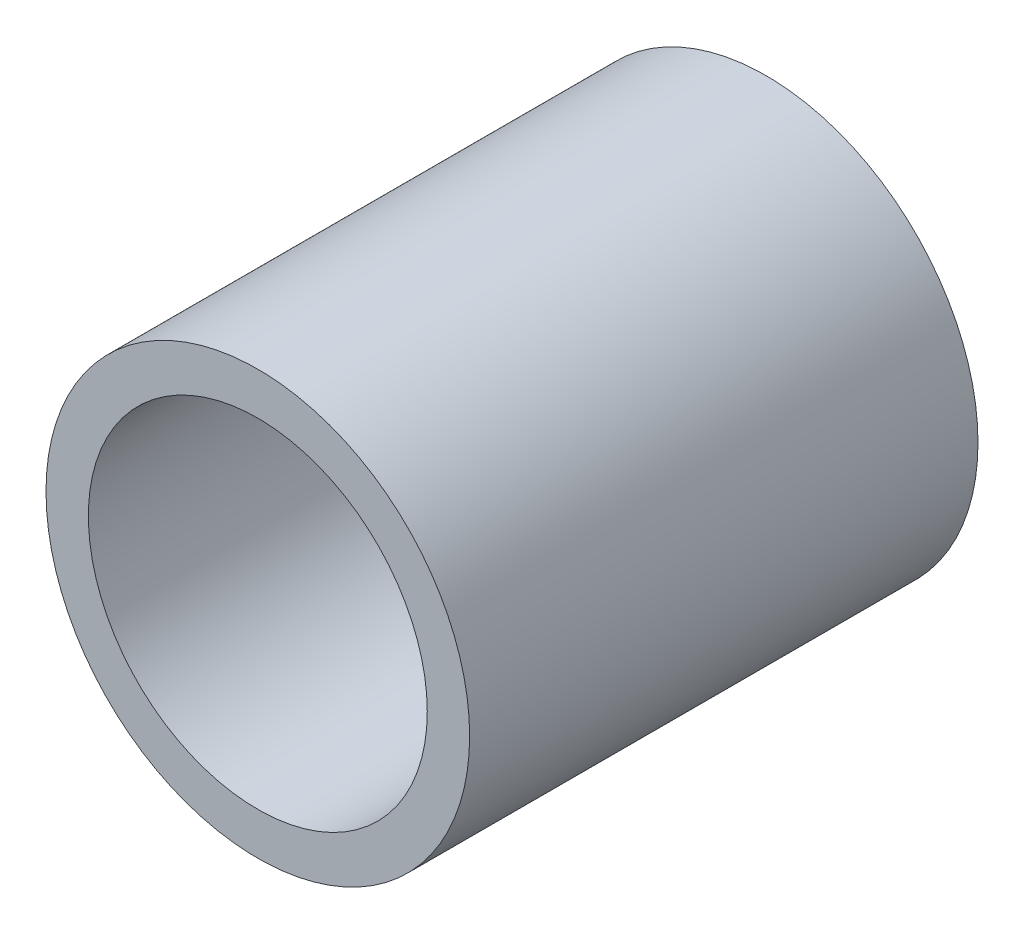
ISO-10303-21;
HEADER;
FILE_DESCRIPTION(('STEP AP214'),'2;1');
FILE_NAME('part.step','',(''),(''),'','','');
FILE_SCHEMA(('AUTOMOTIVE_DESIGN { 1 0 10303 214 1 1 1 1 }'));
ENDSEC;
DATA;
#1=APPLICATION_CONTEXT('core data for automotive mechanical design processes');
#2=APPLICATION_PROTOCOL_DEFINITION('international standard','automotive_design',2000,#1);
#3=PRODUCT_CONTEXT('',#1,'mechanical');
#4=PRODUCT('Part','Part','',(#3));
#5=PRODUCT_RELATED_PRODUCT_CATEGORY('part','',(#4));
#6=PRODUCT_DEFINITION_FORMATION('','',#4);
#7=PRODUCT_DEFINITION_CONTEXT('part definition',#1,'design');
#8=PRODUCT_DEFINITION('design','',#6,#7);
#9=PRODUCT_DEFINITION_SHAPE('','',#8);
#10=(LENGTH_UNIT() NAMED_UNIT(*) SI_UNIT(.MILLI.,.METRE.));
#11=(NAMED_UNIT(*) PLANE_ANGLE_UNIT() SI_UNIT($,.RADIAN.));
#12=(NAMED_UNIT(*) SI_UNIT($,.STERADIAN.) SOLID_ANGLE_UNIT());
#13=UNCERTAINTY_MEASURE_WITH_UNIT(LENGTH_MEASURE(1.E-05),#10,'distance_accuracy_value','');
#14=(GEOMETRIC_REPRESENTATION_CONTEXT(3) GLOBAL_UNCERTAINTY_ASSIGNED_CONTEXT((#13)) GLOBAL_UNIT_ASSIGNED_CONTEXT((#10,
#11,#12)) REPRESENTATION_CONTEXT('',''));
#15=CARTESIAN_POINT('',(0.,0.,0.));
#16=DIRECTION('',(0.,0.,1.));
#17=DIRECTION('',(1.,0.,0.));
#18=AXIS2_PLACEMENT_3D('',#15,#16,#17);
#19=CARTESIAN_POINT('',(0.,0.,0.3));
#20=DIRECTION('',(0.,0.,1.));
#21=DIRECTION('',(1.,0.,0.));
#22=AXIS2_PLACEMENT_3D('',#19,#20,#21);
#23=PLANE('',#22);
#24=CARTESIAN_POINT('',(0.,0.,0.3));
#25=DIRECTION('',(0.,0.,1.));
#26=DIRECTION('',(1.,0.,0.));
#27=AXIS2_PLACEMENT_3D('',#24,#25,#26);
#28=CIRCLE('',#27,0.125);
#29=CARTESIAN_POINT('',(0.125,0.,0.3));
#30=VERTEX_POINT('',#29);
#31=EDGE_CURVE('E10',#30,#30,#28,.T.);
#32=ORIENTED_EDGE('',*,*,#31,.T.);
#33=EDGE_LOOP('',(#32));
#34=FACE_BOUND('',#33,.T.);
#35=CARTESIAN_POINT('',(0.,0.,0.3));
#36=DIRECTION('',(0.,0.,1.));
#37=DIRECTION('',(1.,0.,0.));
#38=AXIS2_PLACEMENT_3D('',#35,#36,#37);
#39=CIRCLE('',#38,0.1);
#40=CARTESIAN_POINT('',(0.1,0.,0.3));
#41=VERTEX_POINT('',#40);
#42=EDGE_CURVE('E50',#41,#41,#39,.T.);
#43=ORIENTED_EDGE('',*,*,#42,.F.);
#44=EDGE_LOOP('',(#43));
#45=FACE_BOUND('',#44,.T.);
#46=ADVANCED_FACE('F37',(#34,#45),#23,.T.);
#47=CARTESIAN_POINT('',(0.,0.,0.));
#48=DIRECTION('',(0.,0.,1.));
#49=DIRECTION('',(1.,0.,0.));
#50=AXIS2_PLACEMENT_3D('',#47,#48,#49);
#51=PLANE('',#50);
#52=CARTESIAN_POINT('',(0.,0.,0.));
#53=DIRECTION('',(0.,0.,1.));
#54=DIRECTION('',(1.,0.,0.));
#55=AXIS2_PLACEMENT_3D('',#52,#53,#54);
#56=CIRCLE('',#55,0.125);
#57=CARTESIAN_POINT('',(0.125,0.,0.));
#58=VERTEX_POINT('',#57);
#59=EDGE_CURVE('E41',#58,#58,#56,.T.);
#60=ORIENTED_EDGE('',*,*,#59,.F.);
#61=EDGE_LOOP('',(#60));
#62=FACE_BOUND('',#61,.T.);
#63=CARTESIAN_POINT('',(0.,0.,0.));
#64=DIRECTION('',(0.,0.,1.));
#65=DIRECTION('',(1.,0.,0.));
#66=AXIS2_PLACEMENT_3D('',#63,#64,#65);
#67=CIRCLE('',#66,0.1);
#68=CARTESIAN_POINT('',(0.1,0.,0.));
#69=VERTEX_POINT('',#68);
#70=EDGE_CURVE('E52',#69,#69,#67,.T.);
#71=ORIENTED_EDGE('',*,*,#70,.T.);
#72=EDGE_LOOP('',(#71));
#73=FACE_BOUND('',#72,.T.);
#74=ADVANCED_FACE('F64',(#62,#73),#51,.F.);
#75=CARTESIAN_POINT('',(0.,0.,0.3));
#76=DIRECTION('',(0.,0.,-1.));
#77=DIRECTION('',(-1.,0.,0.));
#78=AXIS2_PLACEMENT_3D('',#75,#76,#77);
#79=CYLINDRICAL_SURFACE('',#78,0.125);
#80=ORIENTED_EDGE('',*,*,#31,.F.);
#81=EDGE_LOOP('',(#80));
#82=FACE_BOUND('',#81,.T.);
#83=ORIENTED_EDGE('',*,*,#59,.T.);
#84=EDGE_LOOP('',(#83));
#85=FACE_BOUND('',#84,.T.);
#86=ADVANCED_FACE('F39',(#82,#85),#79,.T.);
#87=CARTESIAN_POINT('',(0.,0.,0.3));
#88=DIRECTION('',(0.,0.,-1.));
#89=DIRECTION('',(-1.,0.,0.));
#90=AXIS2_PLACEMENT_3D('',#87,#88,#89);
#91=CYLINDRICAL_SURFACE('',#90,0.1);
#92=ORIENTED_EDGE('',*,*,#42,.T.);
#93=EDGE_LOOP('',(#92));
#94=FACE_BOUND('',#93,.T.);
#95=ORIENTED_EDGE('',*,*,#70,.F.);
#96=EDGE_LOOP('',(#95));
#97=FACE_BOUND('',#96,.T.);
#98=ADVANCED_FACE('F60',(#94,#97),#91,.F.);
#99=CLOSED_SHELL('',(#46,#74,#86,#98));
#100=MANIFOLD_SOLID_BREP('B2',#99);
#101=ADVANCED_BREP_SHAPE_REPRESENTATION('',(#18,#100),#14);
#102=SHAPE_DEFINITION_REPRESENTATION(#9,#101);
ENDSEC;
END-ISO-10303-21;
